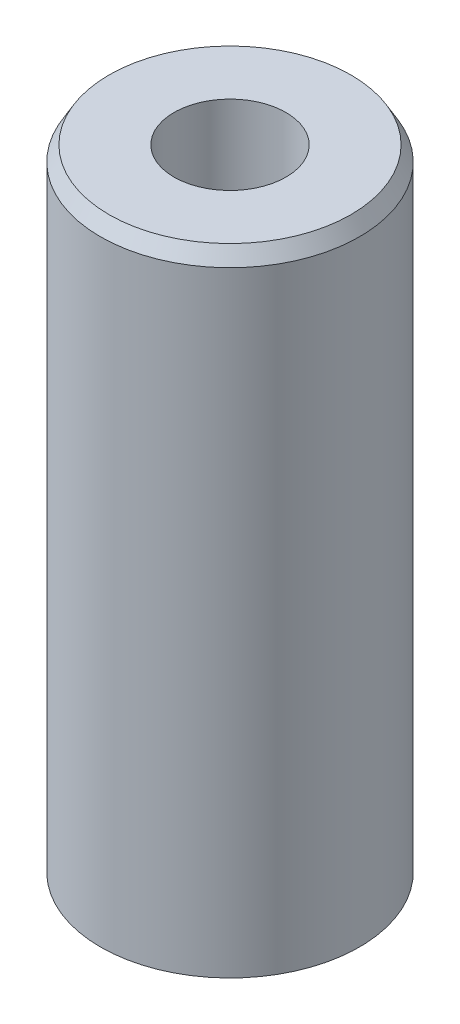
ISO-10303-21;
HEADER;
FILE_DESCRIPTION(('STEP AP214'),'2;1');
FILE_NAME('part.step','',(''),(''),'','','');
FILE_SCHEMA(('AUTOMOTIVE_DESIGN { 1 0 10303 214 1 1 1 1 }'));
ENDSEC;
DATA;
#1=APPLICATION_CONTEXT('core data for automotive mechanical design processes');
#2=APPLICATION_PROTOCOL_DEFINITION('international standard','automotive_design',2000,#1);
#3=PRODUCT_CONTEXT('',#1,'mechanical');
#4=PRODUCT('Part','Part','',(#3));
#5=PRODUCT_RELATED_PRODUCT_CATEGORY('part','',(#4));
#6=PRODUCT_DEFINITION_FORMATION('','',#4);
#7=PRODUCT_DEFINITION_CONTEXT('part definition',#1,'design');
#8=PRODUCT_DEFINITION('design','',#6,#7);
#9=PRODUCT_DEFINITION_SHAPE('','',#8);
#10=(LENGTH_UNIT() NAMED_UNIT(*) SI_UNIT(.MILLI.,.METRE.));
#11=(NAMED_UNIT(*) PLANE_ANGLE_UNIT() SI_UNIT($,.RADIAN.));
#12=(NAMED_UNIT(*) SI_UNIT($,.STERADIAN.) SOLID_ANGLE_UNIT());
#13=UNCERTAINTY_MEASURE_WITH_UNIT(LENGTH_MEASURE(1.E-05),#10,'distance_accuracy_value','');
#14=(GEOMETRIC_REPRESENTATION_CONTEXT(3) GLOBAL_UNCERTAINTY_ASSIGNED_CONTEXT((#13)) GLOBAL_UNIT_ASSIGNED_CONTEXT((#10,
#11,#12)) REPRESENTATION_CONTEXT('',''));
#15=CARTESIAN_POINT('',(0.,0.,0.));
#16=DIRECTION('',(0.,0.,1.));
#17=DIRECTION('',(1.,0.,0.));
#18=AXIS2_PLACEMENT_3D('',#15,#16,#17);
#19=CARTESIAN_POINT('',(0.,86.2438047030552,0.));
#20=DIRECTION('',(0.,-1.,0.));
#21=DIRECTION('',(0.,0.,-1.));
#22=AXIS2_PLACEMENT_3D('',#19,#20,#21);
#23=CYLINDRICAL_SURFACE('',#22,17.5);
#24=CARTESIAN_POINT('',(0.,84.2355917887812,0.));
#25=DIRECTION('',(0.,1.,0.));
#26=DIRECTION('',(0.,0.,1.));
#27=AXIS2_PLACEMENT_3D('',#24,#25,#26);
#28=CIRCLE('',#27,17.5);
#29=CARTESIAN_POINT('',(0.,84.2355917887812,17.5));
#30=VERTEX_POINT('',#29);
#31=EDGE_CURVE('E50',#30,#30,#28,.F.);
#32=ORIENTED_EDGE('',*,*,#31,.T.);
#33=EDGE_LOOP('',(#32));
#34=FACE_BOUND('',#33,.T.);
#35=CARTESIAN_POINT('',(0.,1.15944226664615,0.));
#36=DIRECTION('',(0.,1.,0.));
#37=DIRECTION('',(0.,0.,1.));
#38=AXIS2_PLACEMENT_3D('',#35,#36,#37);
#39=CIRCLE('',#38,17.5);
#40=CARTESIAN_POINT('',(0.,1.15944226664615,17.5));
#41=VERTEX_POINT('',#40);
#42=EDGE_CURVE('E51',#41,#41,#39,.T.);
#43=ORIENTED_EDGE('',*,*,#42,.T.);
#44=EDGE_LOOP('',(#43));
#45=FACE_BOUND('',#44,.T.);
#46=ADVANCED_FACE('F39',(#34,#45),#23,.T.);
#47=CARTESIAN_POINT('',(0.,86.2438047030552,0.));
#48=DIRECTION('',(0.,1.,0.));
#49=DIRECTION('',(0.,0.,1.));
#50=AXIS2_PLACEMENT_3D('',#47,#48,#49);
#51=PLANE('',#50);
#52=CARTESIAN_POINT('',(0.,86.2438047030552,0.));
#53=DIRECTION('',(0.,1.,0.));
#54=DIRECTION('',(0.,0.,1.));
#55=AXIS2_PLACEMENT_3D('',#52,#53,#54);
#56=CIRCLE('',#55,16.3405577333538);
#57=CARTESIAN_POINT('',(0.,86.2438047030552,16.3405577333538));
#58=VERTEX_POINT('',#57);
#59=EDGE_CURVE('E54',#58,#58,#56,.T.);
#60=ORIENTED_EDGE('',*,*,#59,.T.);
#61=EDGE_LOOP('',(#60));
#62=FACE_BOUND('',#61,.T.);
#63=CARTESIAN_POINT('',(0.,86.2438047030552,0.));
#64=DIRECTION('',(0.,1.,0.));
#65=DIRECTION('',(0.,0.,1.));
#66=AXIS2_PLACEMENT_3D('',#63,#64,#65);
#67=CIRCLE('',#66,7.56475086734325);
#68=CARTESIAN_POINT('',(0.,86.2438047030552,7.56475086734325));
#69=VERTEX_POINT('',#68);
#70=EDGE_CURVE('E58',#69,#69,#67,.T.);
#71=ORIENTED_EDGE('',*,*,#70,.F.);
#72=EDGE_LOOP('',(#71));
#73=FACE_BOUND('',#72,.T.);
#74=ADVANCED_FACE('F69',(#62,#73),#51,.T.);
#75=CARTESIAN_POINT('',(0.,0.,0.));
#76=DIRECTION('',(0.,1.,0.));
#77=DIRECTION('',(0.,0.,1.));
#78=AXIS2_PLACEMENT_3D('',#75,#76,#77);
#79=PLANE('',#78);
#80=CARTESIAN_POINT('',(0.,0.,0.));
#81=DIRECTION('',(0.,1.,0.));
#82=DIRECTION('',(0.,0.,1.));
#83=AXIS2_PLACEMENT_3D('',#80,#81,#82);
#84=CIRCLE('',#83,15.491787085726);
#85=CARTESIAN_POINT('',(0.,0.,15.491787085726));
#86=VERTEX_POINT('',#85);
#87=EDGE_CURVE('E10',#86,#86,#84,.F.);
#88=ORIENTED_EDGE('',*,*,#87,.T.);
#89=EDGE_LOOP('',(#88));
#90=FACE_BOUND('',#89,.T.);
#91=CARTESIAN_POINT('',(0.,0.,0.));
#92=DIRECTION('',(0.,1.,0.));
#93=DIRECTION('',(0.,0.,1.));
#94=AXIS2_PLACEMENT_3D('',#91,#92,#93);
#95=CIRCLE('',#94,7.56475086734325);
#96=CARTESIAN_POINT('',(0.,0.,7.56475086734325));
#97=VERTEX_POINT('',#96);
#98=EDGE_CURVE('E63',#97,#97,#95,.T.);
#99=ORIENTED_EDGE('',*,*,#98,.T.);
#100=EDGE_LOOP('',(#99));
#101=FACE_BOUND('',#100,.T.);
#102=ADVANCED_FACE('F75',(#90,#101),#79,.F.);
#103=CARTESIAN_POINT('',(0.,86.2438047030552,0.));
#104=DIRECTION('',(0.,-1.,0.));
#105=DIRECTION('',(0.,0.,-1.));
#106=AXIS2_PLACEMENT_3D('',#103,#104,#105);
#107=CYLINDRICAL_SURFACE('',#106,7.56475086734325);
#108=ORIENTED_EDGE('',*,*,#70,.T.);
#109=EDGE_LOOP('',(#108));
#110=FACE_BOUND('',#109,.T.);
#111=ORIENTED_EDGE('',*,*,#98,.F.);
#112=EDGE_LOOP('',(#111));
#113=FACE_BOUND('',#112,.T.);
#114=ADVANCED_FACE('F70',(#110,#113),#107,.F.);
#115=CARTESIAN_POINT('',(0.,86.2438047030552,0.));
#116=DIRECTION('',(0.,-1.,0.));
#117=DIRECTION('',(0.,0.,-1.));
#118=AXIS2_PLACEMENT_3D('',#115,#116,#117);
#119=CONICAL_SURFACE('',#118,16.3405577333538,0.523598775598298);
#120=ORIENTED_EDGE('',*,*,#31,.F.);
#121=EDGE_LOOP('',(#120));
#122=FACE_BOUND('',#121,.T.);
#123=ORIENTED_EDGE('',*,*,#59,.F.);
#124=EDGE_LOOP('',(#123));
#125=FACE_BOUND('',#124,.T.);
#126=ADVANCED_FACE('F81',(#122,#125),#119,.T.);
#127=CARTESIAN_POINT('',(0.,1.15944226664615,0.));
#128=DIRECTION('',(0.,1.,0.));
#129=DIRECTION('',(0.,0.,1.));
#130=AXIS2_PLACEMENT_3D('',#127,#128,#129);
#131=CONICAL_SURFACE('',#130,17.5,1.0471975511966);
#132=ORIENTED_EDGE('',*,*,#87,.F.);
#133=EDGE_LOOP('',(#132));
#134=FACE_BOUND('',#133,.T.);
#135=ORIENTED_EDGE('',*,*,#42,.F.);
#136=EDGE_LOOP('',(#135));
#137=FACE_BOUND('',#136,.T.);
#138=ADVANCED_FACE('F45',(#134,#137),#131,.T.);
#139=CLOSED_SHELL('',(#46,#74,#102,#114,#126,#138));
#140=MANIFOLD_SOLID_BREP('B2',#139);
#141=ADVANCED_BREP_SHAPE_REPRESENTATION('',(#18,#140),#14);
#142=SHAPE_DEFINITION_REPRESENTATION(#9,#141);
ENDSEC;
END-ISO-10303-21;
